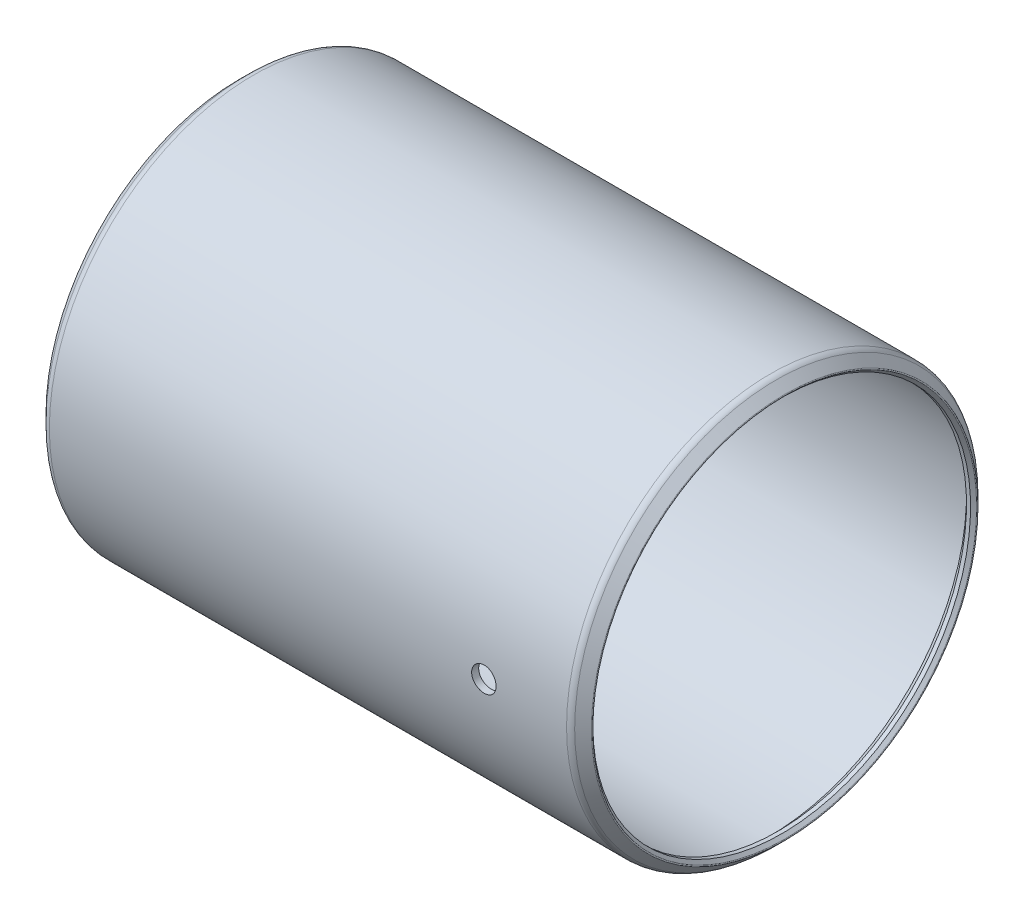
ISO-10303-21;
HEADER;
FILE_DESCRIPTION(('STEP AP214'),'2;1');
FILE_NAME('part.step','',(''),(''),'','','');
FILE_SCHEMA(('AUTOMOTIVE_DESIGN { 1 0 10303 214 1 1 1 1 }'));
ENDSEC;
DATA;
#1=APPLICATION_CONTEXT('core data for automotive mechanical design processes');
#2=APPLICATION_PROTOCOL_DEFINITION('international standard','automotive_design',2000,#1);
#3=PRODUCT_CONTEXT('',#1,'mechanical');
#4=PRODUCT('Part','Part','',(#3));
#5=PRODUCT_RELATED_PRODUCT_CATEGORY('part','',(#4));
#6=PRODUCT_DEFINITION_FORMATION('','',#4);
#7=PRODUCT_DEFINITION_CONTEXT('part definition',#1,'design');
#8=PRODUCT_DEFINITION('design','',#6,#7);
#9=PRODUCT_DEFINITION_SHAPE('','',#8);
#10=(LENGTH_UNIT() NAMED_UNIT(*) SI_UNIT(.MILLI.,.METRE.));
#11=(NAMED_UNIT(*) PLANE_ANGLE_UNIT() SI_UNIT($,.RADIAN.));
#12=(NAMED_UNIT(*) SI_UNIT($,.STERADIAN.) SOLID_ANGLE_UNIT());
#13=UNCERTAINTY_MEASURE_WITH_UNIT(LENGTH_MEASURE(1.E-05),#10,'distance_accuracy_value','');
#14=(GEOMETRIC_REPRESENTATION_CONTEXT(3) GLOBAL_UNCERTAINTY_ASSIGNED_CONTEXT((#13)) GLOBAL_UNIT_ASSIGNED_CONTEXT((#10,
#11,#12)) REPRESENTATION_CONTEXT('',''));
#15=CARTESIAN_POINT('',(0.,0.,0.));
#16=DIRECTION('',(0.,0.,1.));
#17=DIRECTION('',(1.,0.,0.));
#18=AXIS2_PLACEMENT_3D('',#15,#16,#17);
#19=CARTESIAN_POINT('',(68.961,0.,0.));
#20=DIRECTION('',(-1.,0.,0.));
#21=DIRECTION('',(0.,0.,1.));
#22=AXIS2_PLACEMENT_3D('',#19,#20,#21);
#23=CYLINDRICAL_SURFACE('',#22,25.57145);
#24=CARTESIAN_POINT('',(1.0541,0.,0.));
#25=DIRECTION('',(-1.,0.,0.));
#26=DIRECTION('',(0.,0.,1.));
#27=AXIS2_PLACEMENT_3D('',#24,#25,#26);
#28=CIRCLE('',#27,25.57145);
#29=CARTESIAN_POINT('',(1.0541,0.,25.57145));
#30=VERTEX_POINT('',#29);
#31=EDGE_CURVE('E56',#30,#30,#28,.T.);
#32=ORIENTED_EDGE('',*,*,#31,.T.);
#33=EDGE_LOOP('',(#32));
#34=FACE_BOUND('',#33,.T.);
#35=CARTESIAN_POINT('',(67.9069,0.,0.));
#36=DIRECTION('',(-1.,0.,0.));
#37=DIRECTION('',(0.,0.,1.));
#38=AXIS2_PLACEMENT_3D('',#35,#36,#37);
#39=CIRCLE('',#38,25.57145);
#40=CARTESIAN_POINT('',(67.9069,0.,25.57145));
#41=VERTEX_POINT('',#40);
#42=EDGE_CURVE('E59',#41,#41,#39,.T.);
#43=ORIENTED_EDGE('',*,*,#42,.F.);
#44=EDGE_LOOP('',(#43));
#45=FACE_BOUND('',#44,.T.);
#46=CARTESIAN_POINT('',(58.9026,0.,25.57145));
#47=CARTESIAN_POINT('',(58.9025960800923,-0.0890785264665203,25.5714493447716));
#48=CARTESIAN_POINT('',(58.8950771837364,-0.178219454826774,25.5709795623505));
#49=CARTESIAN_POINT('',(58.8651906890871,-0.354040013814786,25.5691506713592));
#50=CARTESIAN_POINT('',(58.8428058003499,-0.440716655702507,25.5677905272471));
#51=CARTESIAN_POINT('',(58.7838326677164,-0.609036416633367,25.5643347845169));
#52=CARTESIAN_POINT('',(58.7472519067132,-0.69068216132043,25.5622395734213));
#53=CARTESIAN_POINT('',(58.6609375297746,-0.846653095066667,25.5575493611547));
#54=CARTESIAN_POINT('',(58.611206929516,-0.920979957221841,25.5549544746122));
#55=CARTESIAN_POINT('',(58.4999238638662,-1.06033460911293,25.5495523034618));
#56=CARTESIAN_POINT('',(58.438356065411,-1.12535014491725,25.5467447462656));
#57=CARTESIAN_POINT('',(58.3051778526818,-1.24413181337361,25.5412359896133));
#58=CARTESIAN_POINT('',(58.2335670193243,-1.29789747634882,25.5385347946017));
#59=CARTESIAN_POINT('',(58.0822662690385,-1.39269082770399,25.5335412842431));
#60=CARTESIAN_POINT('',(58.0025699736334,-1.43370835402017,25.5312492957076));
#61=CARTESIAN_POINT('',(57.8374053075456,-1.50177606410441,25.5273361885206));
#62=CARTESIAN_POINT('',(57.7519369982689,-1.52882639643714,25.5257150627334));
#63=CARTESIAN_POINT('',(57.577772334744,-1.568157895832,25.5233290878996));
#64=CARTESIAN_POINT('',(57.4890803254064,-1.58045823417964,25.5225631274425));
#65=CARTESIAN_POINT('',(57.3108873992574,-1.58999976422782,25.521970531941));
#66=CARTESIAN_POINT('',(57.2213864915153,-1.58724112456086,25.522143886378));
#67=CARTESIAN_POINT('',(57.0442469925509,-1.56675891829479,25.523409339604));
#68=CARTESIAN_POINT('',(56.9566059922457,-1.54905609692806,25.5245001647696));
#69=CARTESIAN_POINT('',(56.7855419336435,-1.49922022152947,25.5274756237116));
#70=CARTESIAN_POINT('',(56.7021189003468,-1.4670870819784,25.5293602621923));
#71=CARTESIAN_POINT('',(56.5417921996034,-1.3892791567144,25.5337124255201));
#72=CARTESIAN_POINT('',(56.4648931114878,-1.34359495865048,25.5361803552692));
#73=CARTESIAN_POINT('',(56.3198472511375,-1.23998854625602,25.5414205740083));
#74=CARTESIAN_POINT('',(56.2517005759537,-1.18206619624176,25.5441928663726));
#75=CARTESIAN_POINT('',(56.1259732738258,-1.05551083369737,25.5497350451122));
#76=CARTESIAN_POINT('',(56.0684107173303,-0.986859866887192,25.5525049194825));
#77=CARTESIAN_POINT('',(55.9656250239797,-0.840858968683621,25.5577256050605));
#78=CARTESIAN_POINT('',(55.9204018913823,-0.763509034288757,25.560176416158));
#79=CARTESIAN_POINT('',(55.8435803030942,-0.602294938215073,25.564482995108));
#80=CARTESIAN_POINT('',(55.8119825298126,-0.518430450511195,25.5663387331558));
#81=CARTESIAN_POINT('',(55.7633206674,-0.34657274273392,25.56924564687));
#82=CARTESIAN_POINT('',(55.7462564107983,-0.258579570248,25.5702968318073));
#83=CARTESIAN_POINT('',(55.7271683605088,-0.0811190864972093,25.5714749918259));
#84=CARTESIAN_POINT('',(55.7251195824085,0.00834552764598569,25.571603502148));
#85=CARTESIAN_POINT('',(55.7360553690338,0.186347157410752,25.5709259148492));
#86=CARTESIAN_POINT('',(55.7490398565871,0.274884177791705,25.5701198220261));
#87=CARTESIAN_POINT('',(55.7896529056559,0.448447007435653,25.5676647643642));
#88=CARTESIAN_POINT('',(55.8172700063826,0.533475508595245,25.5660164592125));
#89=CARTESIAN_POINT('',(55.8863526936012,0.697690729990357,25.562062422209));
#90=CARTESIAN_POINT('',(55.9278184029977,0.776877398372753,25.5597566845228));
#91=CARTESIAN_POINT('',(56.0234848618106,0.92727555718359,25.5547430503514));
#92=CARTESIAN_POINT('',(56.0777022999295,0.998476414358508,25.5520346285808));
#93=CARTESIAN_POINT('',(56.1973088867885,1.13077478120164,25.5465221980211));
#94=CARTESIAN_POINT('',(56.2626981440946,1.19187219267486,25.5437181883034));
#95=CARTESIAN_POINT('',(56.4028999871315,1.30231394947933,25.5383261710364));
#96=CARTESIAN_POINT('',(56.4777253529806,1.35164208760784,25.5357384645008));
#97=CARTESIAN_POINT('',(56.6346111462359,1.43703419209743,25.5310756619567));
#98=CARTESIAN_POINT('',(56.716671529506,1.47309823936686,25.5290005628214));
#99=CARTESIAN_POINT('',(56.8856387345417,1.530910364964,25.5255991585257));
#100=CARTESIAN_POINT('',(56.9725420532342,1.55266864904231,25.5242723196518));
#101=CARTESIAN_POINT('',(57.1487769402625,1.58128494366194,25.522515584211));
#102=CARTESIAN_POINT('',(57.2381084848735,1.58814309973038,25.5220856788837));
#103=CARTESIAN_POINT('',(57.4165028641642,1.58676305768005,25.5221715035137));
#104=CARTESIAN_POINT('',(57.5055658978509,1.57855034051779,25.5226856373453));
#105=CARTESIAN_POINT('',(57.6810457992229,1.54731450354691,25.5245982218144));
#106=CARTESIAN_POINT('',(57.7674626621029,1.52429135684587,25.5259966740576));
#107=CARTESIAN_POINT('',(57.9352010689119,1.46409391711999,25.5295199119532));
#108=CARTESIAN_POINT('',(58.0165226461441,1.42691971659899,25.5316446928577));
#109=CARTESIAN_POINT('',(58.1717734420451,1.33947894953243,25.5363811045386));
#110=CARTESIAN_POINT('',(58.2457028534327,1.2892127244278,25.5389927226177));
#111=CARTESIAN_POINT('',(58.3841998743928,1.17692069068623,25.5444136474425));
#112=CARTESIAN_POINT('',(58.4487525547836,1.11487648424476,25.5472232590882));
#113=CARTESIAN_POINT('',(58.5665483947497,0.980813965322818,25.5527209869188));
#114=CARTESIAN_POINT('',(58.6197887828363,0.90879321573264,25.5554090732036));
#115=CARTESIAN_POINT('',(58.7134874112872,0.756740965553976,25.5603636031448));
#116=CARTESIAN_POINT('',(58.7539298909716,0.676699746126725,25.5626295255039));
#117=CARTESIAN_POINT('',(58.8207525493497,0.511007368356208,25.5664773734879));
#118=CARTESIAN_POINT('',(58.8471492026055,0.425362915184585,25.5680601000301));
#119=CARTESIAN_POINT('',(58.8782678943832,0.282661836612508,25.5699483183568));
#120=CARTESIAN_POINT('',(58.8873806406946,0.226527688897208,25.5705089473229));
#121=CARTESIAN_POINT('',(58.8995479394458,0.113604155135488,25.5712599968465));
#122=CARTESIAN_POINT('',(58.9026025001385,0.0568147699817819,25.5714504179083));
#123=CARTESIAN_POINT('',(58.9026,0.,25.57145));
#124=B_SPLINE_CURVE_WITH_KNOTS('',3,(#46,#47,#48,#49,#50,#51,#52,#53,#54,#55,#56,#57,#58,#59,
#60,#61,#62,#63,#64,#65,#66,#67,#68,#69,#70,#71,#72,#73,#74,#75,#76,#77,#78,#79,#80,#81,#82,#83,
#84,#85,#86,#87,#88,#89,#90,#91,#92,#93,#94,#95,#96,#97,#98,#99,#100,#101,#102,#103,#104,#105,
#106,#107,#108,#109,#110,#111,#112,#113,#114,#115,#116,#117,#118,#119,#120,#121,#122,#123),
.UNSPECIFIED.,.T.,.F.,(4,2,2,2,2,2,2,2,2,2,2,2,2,2,2,2,2,2,2,2,2,2,2,2,2,2,2,2,2,2,2,2,2,2,2,2,
2,2,4),(0.,0.267028172209843,0.534367466644888,0.801566032845921,1.06870337497601,
1.33618910794715,1.60368600609295,1.87139559332503,2.1391023329554,2.40646074264499,
2.67381615842455,2.94080104559105,3.20778751502617,3.47495986502432,3.74213517730278,
4.00976249082372,4.27738989668639,4.54503070477631,4.81266842877918,5.07986072624103,
5.34705165209622,5.61403361309798,5.88101794359301,6.1483536508953,6.41569195627032,
6.68339630943289,6.9510990296241,7.2186105625155,7.48611948265367,7.75317653091146,
8.02023406408666,8.28728985156709,8.55433867491109,8.82180812667263,9.08934303254096,
9.35720613805457,9.62475436644668,9.79506662296589,9.96537864747451),.UNSPECIFIED.);
#125=CARTESIAN_POINT('',(58.9026,0.,25.57145));
#126=VERTEX_POINT('',#125);
#127=EDGE_CURVE('E89',#126,#126,#124,.T.);
#128=ORIENTED_EDGE('',*,*,#127,.F.);
#129=EDGE_LOOP('',(#128));
#130=FACE_BOUND('',#129,.T.);
#131=ADVANCED_FACE('F32',(#34,#45,#130),#23,.F.);
#132=CARTESIAN_POINT('',(68.961,0.,0.));
#133=DIRECTION('',(-1.,0.,0.));
#134=DIRECTION('',(0.,0.,1.));
#135=AXIS2_PLACEMENT_3D('',#132,#133,#134);
#136=CYLINDRICAL_SURFACE('',#135,26.4858499999996);
#137=CARTESIAN_POINT('',(0.914400000001245,0.,0.));
#138=DIRECTION('',(-1.,0.,0.));
#139=DIRECTION('',(0.,0.,1.));
#140=AXIS2_PLACEMENT_3D('',#137,#138,#139);
#141=CIRCLE('',#140,26.4858499999996);
#142=CARTESIAN_POINT('',(0.914400000001245,0.,26.4858499999996));
#143=VERTEX_POINT('',#142);
#144=EDGE_CURVE('E80',#143,#143,#141,.T.);
#145=ORIENTED_EDGE('',*,*,#144,.F.);
#146=EDGE_LOOP('',(#145));
#147=FACE_BOUND('',#146,.T.);
#148=CARTESIAN_POINT('',(68.0465999999988,0.,0.));
#149=DIRECTION('',(-1.,0.,0.));
#150=DIRECTION('',(0.,0.,1.));
#151=AXIS2_PLACEMENT_3D('',#148,#149,#150);
#152=CIRCLE('',#151,26.4858499999997);
#153=CARTESIAN_POINT('',(68.0465999999988,0.,26.4858499999997));
#154=VERTEX_POINT('',#153);
#155=EDGE_CURVE('E77',#154,#154,#152,.T.);
#156=ORIENTED_EDGE('',*,*,#155,.T.);
#157=EDGE_LOOP('',(#156));
#158=FACE_BOUND('',#157,.T.);
#159=CARTESIAN_POINT('',(55.7276,0.,26.4858499999996));
#160=CARTESIAN_POINT('',(55.7276039224482,-0.0890847636068653,26.485849366631));
#161=CARTESIAN_POINT('',(55.735123867461,-0.178232082260465,26.4853957388718));
#162=CARTESIAN_POINT('',(55.7650147705106,-0.35406567322625,26.4836297386879));
#163=CARTESIAN_POINT('',(55.7874030612471,-0.440748949963702,26.4823163640431));
#164=CARTESIAN_POINT('',(55.8463857592813,-0.609082012281831,26.4789794645282));
#165=CARTESIAN_POINT('',(55.882972729361,-0.690734407117927,26.4769563114905));
#166=CARTESIAN_POINT('',(55.9693022979496,-0.846717330622771,26.4724274718941));
#167=CARTESIAN_POINT('',(56.0190418629404,-0.92104954220202,26.4699218966375));
#168=CARTESIAN_POINT('',(56.1303406165443,-1.06040685163511,26.4647060087124));
#169=CARTESIAN_POINT('',(56.1919141866504,-1.12542045531024,26.4619954493892));
#170=CARTESIAN_POINT('',(56.3251036206416,-1.24419681767903,26.4566771991166));
#171=CARTESIAN_POINT('',(56.3967199018247,-1.29795910862302,26.4540695124474));
#172=CARTESIAN_POINT('',(56.5480261104615,-1.392741517496,26.4492492023987));
#173=CARTESIAN_POINT('',(56.6277219688072,-1.43375218383997,26.4470368725741));
#174=CARTESIAN_POINT('',(56.7928834475946,-1.50180669707748,26.4432599214114));
#175=CARTESIAN_POINT('',(56.878349010061,-1.52885068428766,26.4416952935663));
#176=CARTESIAN_POINT('',(57.052513941242,-1.56817251615512,26.4393925183946));
#177=CARTESIAN_POINT('',(57.1412092616153,-1.58046823227929,26.4386533708535));
#178=CARTESIAN_POINT('',(57.3194077886153,-1.58999965482356,26.4380819130149));
#179=CARTESIAN_POINT('',(57.4089109867017,-1.58723552026127,26.4382495931423));
#180=CARTESIAN_POINT('',(57.5860628939427,-1.56674054637503,26.4394719525842));
#181=CARTESIAN_POINT('',(57.6737138486975,-1.54902903946888,26.4405254861598));
#182=CARTESIAN_POINT('',(57.8447963573035,-1.49917206575954,26.4433990176374));
#183=CARTESIAN_POINT('',(57.9282278875283,-1.46702651814383,26.4452190198306));
#184=CARTESIAN_POINT('',(58.0885653800972,-1.38919198078229,26.4494216989329));
#185=CARTESIAN_POINT('',(58.1654670705211,-1.34349421145243,26.4518047403936));
#186=CARTESIAN_POINT('',(58.310515219039,-1.23985879182646,26.4568645696333));
#187=CARTESIAN_POINT('',(58.3786615868601,-1.18192101534449,26.4595413604405));
#188=CARTESIAN_POINT('',(58.5043771534016,-1.05534129153477,26.4648921106866));
#189=CARTESIAN_POINT('',(58.5619295056537,-0.98668261093889,26.4675660590067));
#190=CARTESIAN_POINT('',(58.6646934254551,-0.840668740830276,26.4726057194353));
#191=CARTESIAN_POINT('',(58.7099049890073,-0.763313548500803,26.4749714314438));
#192=CARTESIAN_POINT('',(58.7867024728445,-0.602092348163894,26.479128198581));
#193=CARTESIAN_POINT('',(58.8182877662632,-0.518226040826944,26.4809192272708));
#194=CARTESIAN_POINT('',(58.8669249195988,-0.346367788220348,26.4837244362312));
#195=CARTESIAN_POINT('',(58.8839769356472,-0.25837588728284,26.4847386248475));
#196=CARTESIAN_POINT('',(58.9030426402692,-0.0809103991076027,26.485874791749));
#197=CARTESIAN_POINT('',(58.9050796228579,0.0085606771212943,26.485998152041));
#198=CARTESIAN_POINT('',(58.8941182852274,0.18657327315787,26.4853424354069));
#199=CARTESIAN_POINT('',(58.8811200368792,0.275114797406925,26.4845633627947));
#200=CARTESIAN_POINT('',(58.840476495667,0.448689376783002,26.4821913839784));
#201=CARTESIAN_POINT('',(58.8128418786704,0.533724940516425,26.4805990709877));
#202=CARTESIAN_POINT('',(58.7437208840186,0.697951145615972,26.476779781356));
#203=CARTESIAN_POINT('',(58.7022343917203,0.777141738600427,26.4745527994622));
#204=CARTESIAN_POINT('',(58.6065279218181,0.927536807185121,26.4697110255744));
#205=CARTESIAN_POINT('',(58.5522923739162,0.998731358915672,26.4670957608247));
#206=CARTESIAN_POINT('',(58.4326500235077,1.13101351824133,26.4617733717519));
#207=CARTESIAN_POINT('',(58.3672431195933,1.19210103408004,26.459066246595));
#208=CARTESIAN_POINT('',(58.2270142848882,1.30251387096851,26.4538612607184));
#209=CARTESIAN_POINT('',(58.1521804509007,1.35182408900105,26.4513636713369));
#210=CARTESIAN_POINT('',(57.9952819097408,1.43717930450387,26.4468637183413));
#211=CARTESIAN_POINT('',(57.913217244253,1.47322437843934,26.4448613518725));
#212=CARTESIAN_POINT('',(57.74424189557,1.53099992465248,26.4415796062692));
#213=CARTESIAN_POINT('',(57.6573344816181,1.55273992999961,26.4402997457291));
#214=CARTESIAN_POINT('',(57.481095130786,1.58131936444246,26.4386060035577));
#215=CARTESIAN_POINT('',(57.3917632156727,1.58815892726778,26.4381921141545));
#216=CARTESIAN_POINT('',(57.2133608725811,1.58674205040655,26.4382771767586));
#217=CARTESIAN_POINT('',(57.1242902543434,1.57850935782069,26.4387746928014));
#218=CARTESIAN_POINT('',(56.9487984123893,1.54723086848496,26.440623459395));
#219=CARTESIAN_POINT('',(56.8623771935346,1.52418504455354,26.4419747115124));
#220=CARTESIAN_POINT('',(56.6946334728053,1.46393972762672,26.4453783252566));
#221=CARTESIAN_POINT('',(56.613310953437,1.42674028319559,26.4474306844778));
#222=CARTESIAN_POINT('',(56.4580629299471,1.33924708809902,26.4520051798612));
#223=CARTESIAN_POINT('',(56.3841372264325,1.28895369053354,26.454527303355));
#224=CARTESIAN_POINT('',(56.2456611844989,1.17661287730875,26.4597617154934));
#225=CARTESIAN_POINT('',(56.1811247037669,1.11454839337705,26.4624742766331));
#226=CARTESIAN_POINT('',(56.0633649023504,0.980448245376988,26.4677816264792));
#227=CARTESIAN_POINT('',(56.0101443568325,0.908410142473017,26.4703763861732));
#228=CARTESIAN_POINT('',(55.9164911895776,0.75633135825357,26.4751582378586));
#229=CARTESIAN_POINT('',(55.8760736597449,0.676281377845187,26.4773448474948));
#230=CARTESIAN_POINT('',(55.8093017285571,0.510577096263029,26.4810573935168));
#231=CARTESIAN_POINT('',(55.7829308255262,0.424929504495323,26.4825841047376));
#232=CARTESIAN_POINT('',(55.7518688132919,0.282296746666981,26.4844039147834));
#233=CARTESIAN_POINT('',(55.7427797430571,0.226233980501182,26.4849437927113));
#234=CARTESIAN_POINT('',(55.7306440910617,0.113455934751089,26.4856670367999));
#235=CARTESIAN_POINT('',(55.7275975016796,0.0567406559899069,26.4858504034104));
#236=CARTESIAN_POINT('',(55.7276,0.,26.4858499999996));
#237=B_SPLINE_CURVE_WITH_KNOTS('',3,(#159,#160,#161,#162,#163,#164,#165,#166,#167,#168,#169,
#170,#171,#172,#173,#174,#175,#176,#177,#178,#179,#180,#181,#182,#183,#184,#185,#186,#187,#188,
#189,#190,#191,#192,#193,#194,#195,#196,#197,#198,#199,#200,#201,#202,#203,#204,#205,#206,#207,
#208,#209,#210,#211,#212,#213,#214,#215,#216,#217,#218,#219,#220,#221,#222,#223,#224,#225,#226,
#227,#228,#229,#230,#231,#232,#233,#234,#235,#236),.UNSPECIFIED.,.T.,.F.,(4,2,2,2,2,2,2,2,2,2,2,
2,2,2,2,2,2,2,2,2,2,2,2,2,2,2,2,2,2,2,2,2,2,2,2,2,2,2,4),(0.,0.267047156547606,
0.534406169719341,0.801625329790048,1.06878291203836,1.33626723920897,1.60376268427004,
1.87145592860238,2.13914648349436,2.40651233106032,2.67387535550437,2.94089311081186,
3.20791236110256,3.47510497471763,3.74230034303514,4.00991699916015,4.27753374196448,
4.54516279496107,4.81278897277133,5.07999987325915,5.34720949643845,5.61422448296871,
5.88124167946426,6.14858669145638,6.41593413039836,6.68362259240975,6.95130951134197,
7.21881785934107,7.4863238064765,7.75340864712177,8.02049397785949,8.28757839217542,
8.55465560486697,8.8221230864943,9.08965608748149,9.35750328676868,9.62503512702408,
9.79512537973618,9.96521541791172),.UNSPECIFIED.);
#238=CARTESIAN_POINT('',(55.7276,0.,26.4858499999996));
#239=VERTEX_POINT('',#238);
#240=EDGE_CURVE('E10',#239,#239,#237,.T.);
#241=ORIENTED_EDGE('',*,*,#240,.F.);
#242=EDGE_LOOP('',(#241));
#243=FACE_BOUND('',#242,.T.);
#244=ADVANCED_FACE('F110',(#147,#158,#243),#136,.T.);
#245=CARTESIAN_POINT('',(-0.829281135627824,0.,0.));
#246=DIRECTION('',(-1.,0.,0.));
#247=DIRECTION('',(0.,0.,1.));
#248=AXIS2_PLACEMENT_3D('',#245,#246,#247);
#249=TOROIDAL_SURFACE('',#248,24.9991862580485,0.126999999999535);
#250=CARTESIAN_POINT('',(-0.919083696838047,0.,0.));
#251=DIRECTION('',(-1.,0.,0.));
#252=DIRECTION('',(0.,0.,1.));
#253=AXIS2_PLACEMENT_3D('',#250,#251,#252);
#254=CIRCLE('',#253,24.909383696838);
#255=CARTESIAN_POINT('',(-0.919083696838047,0.,24.909383696838));
#256=VERTEX_POINT('',#255);
#257=EDGE_CURVE('E43',#256,#256,#254,.T.);
#258=ORIENTED_EDGE('',*,*,#257,.F.);
#259=EDGE_LOOP('',(#258));
#260=FACE_BOUND('',#259,.T.);
#261=CARTESIAN_POINT('',(-0.919083696838047,0.,0.));
#262=DIRECTION('',(-1.,0.,0.));
#263=DIRECTION('',(0.,0.,1.));
#264=AXIS2_PLACEMENT_3D('',#261,#262,#263);
#265=CIRCLE('',#264,25.088988819259);
#266=CARTESIAN_POINT('',(-0.919083696838047,0.,25.088988819259));
#267=VERTEX_POINT('',#266);
#268=EDGE_CURVE('E86',#267,#267,#265,.T.);
#269=ORIENTED_EDGE('',*,*,#268,.T.);
#270=EDGE_LOOP('',(#269));
#271=FACE_BOUND('',#270,.T.);
#272=ADVANCED_FACE('F34',(#260,#271),#249,.T.);
#273=CARTESIAN_POINT('',(-0.919083696838047,0.,0.));
#274=DIRECTION('',(-1.,0.,0.));
#275=DIRECTION('',(0.,0.,1.));
#276=AXIS2_PLACEMENT_3D('',#273,#274,#275);
#277=CONICAL_SURFACE('',#276,24.909383696838,0.785398163397391);
#278=CARTESIAN_POINT('',(-0.527050000000001,0.,0.));
#279=DIRECTION('',(-1.,0.,0.));
#280=DIRECTION('',(0.,0.,1.));
#281=AXIS2_PLACEMENT_3D('',#278,#279,#280);
#282=CIRCLE('',#281,24.51735);
#283=CARTESIAN_POINT('',(-0.527050000000001,0.,24.51735));
#284=VERTEX_POINT('',#283);
#285=EDGE_CURVE('E47',#284,#284,#282,.T.);
#286=ORIENTED_EDGE('',*,*,#285,.F.);
#287=EDGE_LOOP('',(#286));
#288=FACE_BOUND('',#287,.T.);
#289=ORIENTED_EDGE('',*,*,#257,.T.);
#290=EDGE_LOOP('',(#289));
#291=FACE_BOUND('',#290,.T.);
#292=ADVANCED_FACE('F159',(#288,#291),#277,.F.);
#293=CARTESIAN_POINT('',(68.961,0.,0.));
#294=DIRECTION('',(-1.,0.,0.));
#295=DIRECTION('',(0.,0.,1.));
#296=AXIS2_PLACEMENT_3D('',#293,#294,#295);
#297=CYLINDRICAL_SURFACE('',#296,24.51735);
#298=CARTESIAN_POINT('',(0.,0.,0.));
#299=DIRECTION('',(-1.,0.,0.));
#300=DIRECTION('',(0.,0.,1.));
#301=AXIS2_PLACEMENT_3D('',#298,#299,#300);
#302=CIRCLE('',#301,24.51735);
#303=CARTESIAN_POINT('',(0.,0.,24.51735));
#304=VERTEX_POINT('',#303);
#305=EDGE_CURVE('E51',#304,#304,#302,.T.);
#306=ORIENTED_EDGE('',*,*,#305,.F.);
#307=EDGE_LOOP('',(#306));
#308=FACE_BOUND('',#307,.T.);
#309=ORIENTED_EDGE('',*,*,#285,.T.);
#310=EDGE_LOOP('',(#309));
#311=FACE_BOUND('',#310,.T.);
#312=ADVANCED_FACE('F140',(#308,#311),#297,.F.);
#313=CARTESIAN_POINT('',(0.,0.,0.));
#314=DIRECTION('',(1.,0.,0.));
#315=DIRECTION('',(0.,0.,-1.));
#316=AXIS2_PLACEMENT_3D('',#313,#314,#315);
#317=CONICAL_SURFACE('',#316,24.51735,0.785398163397447);
#318=ORIENTED_EDGE('',*,*,#31,.F.);
#319=EDGE_LOOP('',(#318));
#320=FACE_BOUND('',#319,.T.);
#321=ORIENTED_EDGE('',*,*,#305,.T.);
#322=EDGE_LOOP('',(#321));
#323=FACE_BOUND('',#322,.T.);
#324=ADVANCED_FACE('F135',(#320,#323),#317,.F.);
#325=CARTESIAN_POINT('',(67.9069,0.,0.));
#326=DIRECTION('',(-1.,0.,0.));
#327=DIRECTION('',(0.,0.,1.));
#328=AXIS2_PLACEMENT_3D('',#325,#326,#327);
#329=CONICAL_SURFACE('',#328,25.57145,0.785398163397447);
#330=CARTESIAN_POINT('',(68.961,0.,0.));
#331=DIRECTION('',(-1.,0.,0.));
#332=DIRECTION('',(0.,0.,1.));
#333=AXIS2_PLACEMENT_3D('',#330,#331,#332);
#334=CIRCLE('',#333,24.51735);
#335=CARTESIAN_POINT('',(68.961,0.,24.51735));
#336=VERTEX_POINT('',#335);
#337=EDGE_CURVE('E62',#336,#336,#334,.T.);
#338=ORIENTED_EDGE('',*,*,#337,.F.);
#339=EDGE_LOOP('',(#338));
#340=FACE_BOUND('',#339,.T.);
#341=ORIENTED_EDGE('',*,*,#42,.T.);
#342=EDGE_LOOP('',(#341));
#343=FACE_BOUND('',#342,.T.);
#344=ADVANCED_FACE('F132',(#340,#343),#329,.F.);
#345=CARTESIAN_POINT('',(68.961,0.,0.));
#346=DIRECTION('',(-1.,0.,0.));
#347=DIRECTION('',(0.,0.,1.));
#348=AXIS2_PLACEMENT_3D('',#345,#346,#347);
#349=CYLINDRICAL_SURFACE('',#348,24.51735);
#350=CARTESIAN_POINT('',(69.48805,0.,0.));
#351=DIRECTION('',(-1.,0.,0.));
#352=DIRECTION('',(0.,0.,1.));
#353=AXIS2_PLACEMENT_3D('',#350,#351,#352);
#354=CIRCLE('',#353,24.51735);
#355=CARTESIAN_POINT('',(69.48805,0.,24.51735));
#356=VERTEX_POINT('',#355);
#357=EDGE_CURVE('E65',#356,#356,#354,.T.);
#358=ORIENTED_EDGE('',*,*,#357,.F.);
#359=EDGE_LOOP('',(#358));
#360=FACE_BOUND('',#359,.T.);
#361=ORIENTED_EDGE('',*,*,#337,.T.);
#362=EDGE_LOOP('',(#361));
#363=FACE_BOUND('',#362,.T.);
#364=ADVANCED_FACE('F129',(#360,#363),#349,.F.);
#365=CARTESIAN_POINT('',(69.48805,0.,0.));
#366=DIRECTION('',(1.,0.,0.));
#367=DIRECTION('',(0.,0.,-1.));
#368=AXIS2_PLACEMENT_3D('',#365,#366,#367);
#369=CONICAL_SURFACE('',#368,24.51735,0.785398163397462);
#370=CARTESIAN_POINT('',(69.880083696838,0.,0.));
#371=DIRECTION('',(-1.,0.,0.));
#372=DIRECTION('',(0.,0.,1.));
#373=AXIS2_PLACEMENT_3D('',#370,#371,#372);
#374=CIRCLE('',#373,24.909383696838);
#375=CARTESIAN_POINT('',(69.880083696838,0.,24.909383696838));
#376=VERTEX_POINT('',#375);
#377=EDGE_CURVE('E68',#376,#376,#374,.T.);
#378=ORIENTED_EDGE('',*,*,#377,.F.);
#379=EDGE_LOOP('',(#378));
#380=FACE_BOUND('',#379,.T.);
#381=ORIENTED_EDGE('',*,*,#357,.T.);
#382=EDGE_LOOP('',(#381));
#383=FACE_BOUND('',#382,.T.);
#384=ADVANCED_FACE('F125',(#380,#383),#369,.F.);
#385=CARTESIAN_POINT('',(69.7902811356267,0.,0.));
#386=DIRECTION('',(-1.,0.,0.));
#387=DIRECTION('',(0.,0.,1.));
#388=AXIS2_PLACEMENT_3D('',#385,#386,#387);
#389=TOROIDAL_SURFACE('',#388,24.9991862580485,0.127000000000294);
#390=CARTESIAN_POINT('',(69.880083696838,0.,0.));
#391=DIRECTION('',(-1.,0.,0.));
#392=DIRECTION('',(0.,0.,1.));
#393=AXIS2_PLACEMENT_3D('',#390,#391,#392);
#394=CIRCLE('',#393,25.088988819259);
#395=CARTESIAN_POINT('',(69.880083696838,0.,25.088988819259));
#396=VERTEX_POINT('',#395);
#397=EDGE_CURVE('E71',#396,#396,#394,.T.);
#398=ORIENTED_EDGE('',*,*,#397,.F.);
#399=EDGE_LOOP('',(#398));
#400=FACE_BOUND('',#399,.T.);
#401=ORIENTED_EDGE('',*,*,#377,.T.);
#402=EDGE_LOOP('',(#401));
#403=FACE_BOUND('',#402,.T.);
#404=ADVANCED_FACE('F121',(#400,#403),#389,.T.);
#405=CARTESIAN_POINT('',(69.880083696838,0.,0.));
#406=DIRECTION('',(-1.,0.,0.));
#407=DIRECTION('',(0.,0.,1.));
#408=AXIS2_PLACEMENT_3D('',#405,#406,#407);
#409=CONICAL_SURFACE('',#408,25.088988819259,0.785398163397718);
#410=CARTESIAN_POINT('',(68.7919612580504,0.,0.));
#411=DIRECTION('',(-1.,0.,0.));
#412=DIRECTION('',(0.,0.,1.));
#413=AXIS2_PLACEMENT_3D('',#410,#411,#412);
#414=CIRCLE('',#413,26.1771112580471);
#415=CARTESIAN_POINT('',(68.7919612580504,0.,26.1771112580471));
#416=VERTEX_POINT('',#415);
#417=EDGE_CURVE('E74',#416,#416,#414,.T.);
#418=ORIENTED_EDGE('',*,*,#417,.F.);
#419=EDGE_LOOP('',(#418));
#420=FACE_BOUND('',#419,.T.);
#421=ORIENTED_EDGE('',*,*,#397,.T.);
#422=EDGE_LOOP('',(#421));
#423=FACE_BOUND('',#422,.T.);
#424=ADVANCED_FACE('F117',(#420,#423),#409,.T.);
#425=CARTESIAN_POINT('',(68.0465999999988,0.,0.));
#426=DIRECTION('',(-1.,0.,0.));
#427=DIRECTION('',(0.,0.,1.));
#428=AXIS2_PLACEMENT_3D('',#425,#426,#427);
#429=TOROIDAL_SURFACE('',#428,25.4317499999958,1.05410000000387);
#430=ORIENTED_EDGE('',*,*,#155,.F.);
#431=EDGE_LOOP('',(#430));
#432=FACE_BOUND('',#431,.T.);
#433=ORIENTED_EDGE('',*,*,#417,.T.);
#434=EDGE_LOOP('',(#433));
#435=FACE_BOUND('',#434,.T.);
#436=ADVANCED_FACE('F108',(#432,#435),#429,.T.);
#437=CARTESIAN_POINT('',(0.914400000000904,0.,0.));
#438=DIRECTION('',(-1.,0.,0.));
#439=DIRECTION('',(0.,0.,1.));
#440=AXIS2_PLACEMENT_3D('',#437,#438,#439);
#441=TOROIDAL_SURFACE('',#440,25.4317499999972,1.0541000000024);
#442=CARTESIAN_POINT('',(0.169038741950511,0.,0.));
#443=DIRECTION('',(-1.,0.,0.));
#444=DIRECTION('',(0.,0.,1.));
#445=AXIS2_PLACEMENT_3D('',#442,#443,#444);
#446=CIRCLE('',#445,26.1771112580476);
#447=CARTESIAN_POINT('',(0.169038741950511,0.,26.1771112580476));
#448=VERTEX_POINT('',#447);
#449=EDGE_CURVE('E83',#448,#448,#446,.T.);
#450=ORIENTED_EDGE('',*,*,#449,.F.);
#451=EDGE_LOOP('',(#450));
#452=FACE_BOUND('',#451,.T.);
#453=ORIENTED_EDGE('',*,*,#144,.T.);
#454=EDGE_LOOP('',(#453));
#455=FACE_BOUND('',#454,.T.);
#456=ADVANCED_FACE('F105',(#452,#455),#441,.T.);
#457=CARTESIAN_POINT('',(0.169038741950511,0.,0.));
#458=DIRECTION('',(1.,0.,0.));
#459=DIRECTION('',(0.,0.,-1.));
#460=AXIS2_PLACEMENT_3D('',#457,#458,#459);
#461=CONICAL_SURFACE('',#460,26.1771112580476,0.785398163397455);
#462=ORIENTED_EDGE('',*,*,#268,.F.);
#463=EDGE_LOOP('',(#462));
#464=FACE_BOUND('',#463,.T.);
#465=ORIENTED_EDGE('',*,*,#449,.T.);
#466=EDGE_LOOP('',(#465));
#467=FACE_BOUND('',#466,.T.);
#468=ADVANCED_FACE('F101',(#464,#467),#461,.T.);
#469=CARTESIAN_POINT('',(57.3151,0.,26.48585));
#470=DIRECTION('',(0.,0.,-1.));
#471=DIRECTION('',(-1.,0.,0.));
#472=AXIS2_PLACEMENT_3D('',#469,#470,#471);
#473=CYLINDRICAL_SURFACE('',#472,1.5875);
#474=ORIENTED_EDGE('',*,*,#240,.T.);
#475=EDGE_LOOP('',(#474));
#476=FACE_BOUND('',#475,.T.);
#477=ORIENTED_EDGE('',*,*,#127,.T.);
#478=EDGE_LOOP('',(#477));
#479=FACE_BOUND('',#478,.T.);
#480=ADVANCED_FACE('F97',(#476,#479),#473,.F.);
#481=CLOSED_SHELL('',(#131,#244,#272,#292,#312,#324,#344,#364,#384,#404,#424,#436,#456,#468,#480));
#482=MANIFOLD_SOLID_BREP('B2',#481);
#483=ADVANCED_BREP_SHAPE_REPRESENTATION('',(#18,#482),#14);
#484=SHAPE_DEFINITION_REPRESENTATION(#9,#483);
ENDSEC;
END-ISO-10303-21;
